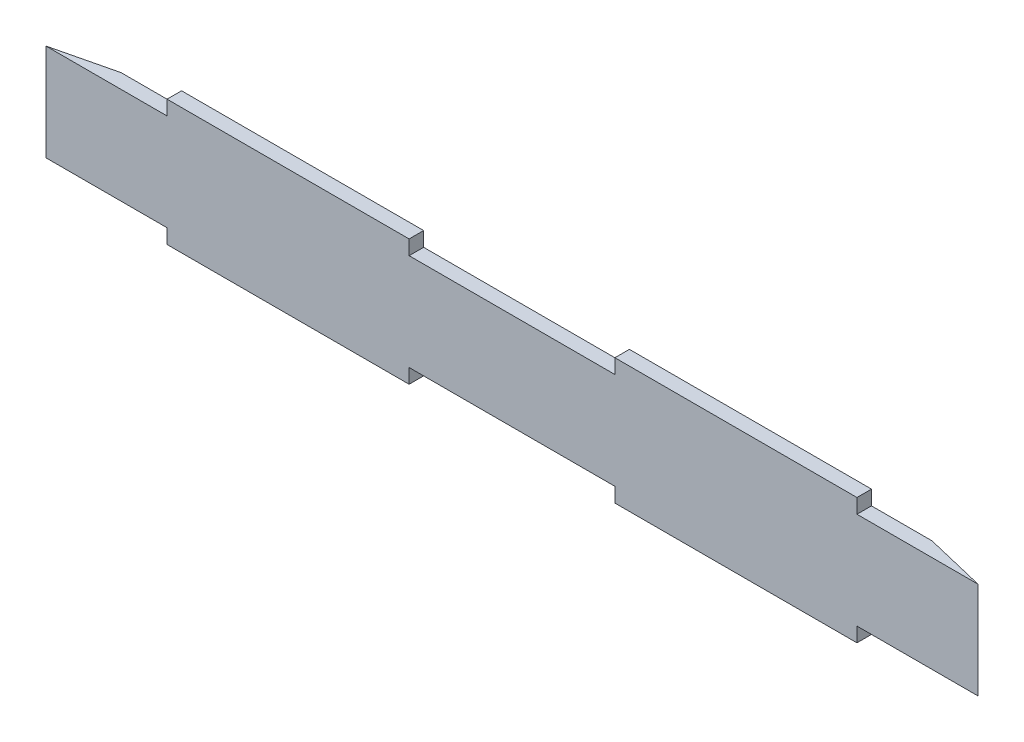
ISO-10303-21;
HEADER;
FILE_DESCRIPTION(('STEP AP214'),'2;1');
FILE_NAME('part.step','',(''),(''),'','','');
FILE_SCHEMA(('AUTOMOTIVE_DESIGN { 1 0 10303 214 1 1 1 1 }'));
ENDSEC;
DATA;
#1=APPLICATION_CONTEXT('core data for automotive mechanical design processes');
#2=APPLICATION_PROTOCOL_DEFINITION('international standard','automotive_design',2000,#1);
#3=PRODUCT_CONTEXT('',#1,'mechanical');
#4=PRODUCT('Part','Part','',(#3));
#5=PRODUCT_RELATED_PRODUCT_CATEGORY('part','',(#4));
#6=PRODUCT_DEFINITION_FORMATION('','',#4);
#7=PRODUCT_DEFINITION_CONTEXT('part definition',#1,'design');
#8=PRODUCT_DEFINITION('design','',#6,#7);
#9=PRODUCT_DEFINITION_SHAPE('','',#8);
#10=(LENGTH_UNIT() NAMED_UNIT(*) SI_UNIT(.MILLI.,.METRE.));
#11=(NAMED_UNIT(*) PLANE_ANGLE_UNIT() SI_UNIT($,.RADIAN.));
#12=(NAMED_UNIT(*) SI_UNIT($,.STERADIAN.) SOLID_ANGLE_UNIT());
#13=UNCERTAINTY_MEASURE_WITH_UNIT(LENGTH_MEASURE(1.E-05),#10,'distance_accuracy_value','');
#14=(GEOMETRIC_REPRESENTATION_CONTEXT(3) GLOBAL_UNCERTAINTY_ASSIGNED_CONTEXT((#13)) GLOBAL_UNIT_ASSIGNED_CONTEXT((#10,
#11,#12)) REPRESENTATION_CONTEXT('',''));
#15=CARTESIAN_POINT('',(0.,0.,0.));
#16=DIRECTION('',(0.,0.,1.));
#17=DIRECTION('',(1.,0.,0.));
#18=AXIS2_PLACEMENT_3D('',#15,#16,#17);
#19=CARTESIAN_POINT('',(192.5,-20.,6.));
#20=DIRECTION('',(0.,1.,0.));
#21=DIRECTION('',(-1.,0.,0.));
#22=AXIS2_PLACEMENT_3D('',#19,#20,#21);
#23=PLANE('',#22);
#24=DIRECTION('',(1.,0.,0.));
#25=VECTOR('',#24,1.);
#26=CARTESIAN_POINT('',(192.5,-20.,6.));
#27=LINE('',#26,#25);
#28=CARTESIAN_POINT('',(-192.5,-20.,6.));
#29=VERTEX_POINT('',#28);
#30=CARTESIAN_POINT('',(-142.5,-20.,6.));
#31=VERTEX_POINT('',#30);
#32=EDGE_CURVE('E199',#29,#31,#27,.T.);
#33=ORIENTED_EDGE('',*,*,#32,.F.);
#34=DIRECTION('',(0.972387301980517,0.,-0.233372952475325));
#35=VECTOR('',#34,1.);
#36=CARTESIAN_POINT('',(171.531770045386,-20.,-81.3676248108927));
#37=LINE('',#36,#35);
#38=CARTESIAN_POINT('',(-167.5,-20.,0.));
#39=VERTEX_POINT('',#38);
#40=EDGE_CURVE('E171',#29,#39,#37,.T.);
#41=ORIENTED_EDGE('',*,*,#40,.T.);
#42=DIRECTION('',(1.,0.,0.));
#43=VECTOR('',#42,1.);
#44=CARTESIAN_POINT('',(192.5,-20.,0.));
#45=LINE('',#44,#43);
#46=CARTESIAN_POINT('',(-142.5,-20.,0.));
#47=VERTEX_POINT('',#46);
#48=EDGE_CURVE('E209',#39,#47,#45,.T.);
#49=ORIENTED_EDGE('',*,*,#48,.T.);
#50=DIRECTION('',(0.,0.,1.));
#51=VECTOR('',#50,1.);
#52=CARTESIAN_POINT('',(-142.5,-20.,0.));
#53=LINE('',#52,#51);
#54=EDGE_CURVE('E269',#47,#31,#53,.T.);
#55=ORIENTED_EDGE('',*,*,#54,.T.);
#56=EDGE_LOOP('',(#33,#41,#49,#55));
#57=FACE_BOUND('',#56,.T.);
#58=ADVANCED_FACE('F34',(#57),#23,.F.);
#59=CARTESIAN_POINT('',(142.5,-20.,0.));
#60=VERTEX_POINT('',#59);
#61=CARTESIAN_POINT('',(167.5,-20.,0.));
#62=VERTEX_POINT('',#61);
#63=EDGE_CURVE('E211',#60,#62,#45,.T.);
#64=ORIENTED_EDGE('',*,*,#63,.T.);
#65=DIRECTION('',(0.972387301980518,0.,0.233372952475324));
#66=VECTOR('',#65,1.);
#67=CARTESIAN_POINT('',(192.5,-20.,6.));
#68=LINE('',#67,#66);
#69=CARTESIAN_POINT('',(192.5,-20.,6.));
#70=VERTEX_POINT('',#69);
#71=EDGE_CURVE('E49',#62,#70,#68,.T.);
#72=ORIENTED_EDGE('',*,*,#71,.T.);
#73=CARTESIAN_POINT('',(142.5,-20.,6.));
#74=VERTEX_POINT('',#73);
#75=EDGE_CURVE('E176',#74,#70,#27,.T.);
#76=ORIENTED_EDGE('',*,*,#75,.F.);
#77=DIRECTION('',(0.,0.,1.));
#78=VECTOR('',#77,1.);
#79=CARTESIAN_POINT('',(142.5,-20.,0.));
#80=LINE('',#79,#78);
#81=EDGE_CURVE('E246',#60,#74,#80,.T.);
#82=ORIENTED_EDGE('',*,*,#81,.F.);
#83=EDGE_LOOP('',(#64,#72,#76,#82));
#84=FACE_BOUND('',#83,.T.);
#85=ADVANCED_FACE('F245',(#84),#23,.F.);
#86=CARTESIAN_POINT('',(192.5,20.,6.));
#87=DIRECTION('',(0.,-1.,0.));
#88=DIRECTION('',(1.,0.,0.));
#89=AXIS2_PLACEMENT_3D('',#86,#87,#88);
#90=PLANE('',#89);
#91=DIRECTION('',(-1.,0.,0.));
#92=VECTOR('',#91,1.);
#93=CARTESIAN_POINT('',(192.5,20.,6.));
#94=LINE('',#93,#92);
#95=CARTESIAN_POINT('',(42.5,20.,6.));
#96=VERTEX_POINT('',#95);
#97=CARTESIAN_POINT('',(-42.5,20.,6.));
#98=VERTEX_POINT('',#97);
#99=EDGE_CURVE('E194',#96,#98,#94,.T.);
#100=ORIENTED_EDGE('',*,*,#99,.F.);
#101=DIRECTION('',(0.,0.,1.));
#102=VECTOR('',#101,1.);
#103=CARTESIAN_POINT('',(42.5,20.,0.));
#104=LINE('',#103,#102);
#105=CARTESIAN_POINT('',(42.5,20.,0.));
#106=VERTEX_POINT('',#105);
#107=EDGE_CURVE('E310',#106,#96,#104,.T.);
#108=ORIENTED_EDGE('',*,*,#107,.F.);
#109=DIRECTION('',(-1.,0.,0.));
#110=VECTOR('',#109,1.);
#111=CARTESIAN_POINT('',(192.5,20.,0.));
#112=LINE('',#111,#110);
#113=CARTESIAN_POINT('',(-42.5,20.,0.));
#114=VERTEX_POINT('',#113);
#115=EDGE_CURVE('E208',#106,#114,#112,.T.);
#116=ORIENTED_EDGE('',*,*,#115,.T.);
#117=DIRECTION('',(0.,0.,1.));
#118=VECTOR('',#117,1.);
#119=CARTESIAN_POINT('',(-42.5,20.,0.));
#120=LINE('',#119,#118);
#121=EDGE_CURVE('E225',#114,#98,#120,.T.);
#122=ORIENTED_EDGE('',*,*,#121,.T.);
#123=EDGE_LOOP('',(#100,#108,#116,#122));
#124=FACE_BOUND('',#123,.T.);
#125=ADVANCED_FACE('F359',(#124),#90,.F.);
#126=CARTESIAN_POINT('',(-142.5,20.,0.));
#127=VERTEX_POINT('',#126);
#128=CARTESIAN_POINT('',(-167.5,20.,0.));
#129=VERTEX_POINT('',#128);
#130=EDGE_CURVE('E186',#127,#129,#112,.T.);
#131=ORIENTED_EDGE('',*,*,#130,.T.);
#132=DIRECTION('',(0.972387301980517,0.,-0.233372952475324));
#133=VECTOR('',#132,1.);
#134=CARTESIAN_POINT('',(-192.5,20.,6.));
#135=LINE('',#134,#133);
#136=CARTESIAN_POINT('',(-192.5,20.,6.));
#137=VERTEX_POINT('',#136);
#138=EDGE_CURVE('E56',#137,#129,#135,.T.);
#139=ORIENTED_EDGE('',*,*,#138,.F.);
#140=CARTESIAN_POINT('',(-142.5,20.,6.));
#141=VERTEX_POINT('',#140);
#142=EDGE_CURVE('E184',#141,#137,#94,.T.);
#143=ORIENTED_EDGE('',*,*,#142,.F.);
#144=DIRECTION('',(0.,0.,1.));
#145=VECTOR('',#144,1.);
#146=CARTESIAN_POINT('',(-142.5,20.,0.));
#147=LINE('',#146,#145);
#148=EDGE_CURVE('E233',#127,#141,#147,.T.);
#149=ORIENTED_EDGE('',*,*,#148,.F.);
#150=EDGE_LOOP('',(#131,#139,#143,#149));
#151=FACE_BOUND('',#150,.T.);
#152=ADVANCED_FACE('F182',(#151),#90,.F.);
#153=CARTESIAN_POINT('',(-42.5,-20.,6.));
#154=VERTEX_POINT('',#153);
#155=CARTESIAN_POINT('',(42.5,-20.,6.));
#156=VERTEX_POINT('',#155);
#157=EDGE_CURVE('E236',#154,#156,#27,.T.);
#158=ORIENTED_EDGE('',*,*,#157,.F.);
#159=DIRECTION('',(0.,0.,1.));
#160=VECTOR('',#159,1.);
#161=CARTESIAN_POINT('',(-42.5,-20.,0.));
#162=LINE('',#161,#160);
#163=CARTESIAN_POINT('',(-42.5,-20.,0.));
#164=VERTEX_POINT('',#163);
#165=EDGE_CURVE('E272',#164,#154,#162,.T.);
#166=ORIENTED_EDGE('',*,*,#165,.F.);
#167=CARTESIAN_POINT('',(42.5,-20.,0.));
#168=VERTEX_POINT('',#167);
#169=EDGE_CURVE('E210',#164,#168,#45,.T.);
#170=ORIENTED_EDGE('',*,*,#169,.T.);
#171=DIRECTION('',(0.,0.,1.));
#172=VECTOR('',#171,1.);
#173=CARTESIAN_POINT('',(42.5,-20.,0.));
#174=LINE('',#173,#172);
#175=EDGE_CURVE('E292',#168,#156,#174,.T.);
#176=ORIENTED_EDGE('',*,*,#175,.T.);
#177=EDGE_LOOP('',(#158,#166,#170,#176));
#178=FACE_BOUND('',#177,.T.);
#179=ADVANCED_FACE('F36',(#178),#23,.F.);
#180=CARTESIAN_POINT('',(192.5,20.,6.));
#181=VERTEX_POINT('',#180);
#182=CARTESIAN_POINT('',(142.5,20.,6.));
#183=VERTEX_POINT('',#182);
#184=EDGE_CURVE('E197',#181,#183,#94,.T.);
#185=ORIENTED_EDGE('',*,*,#184,.F.);
#186=DIRECTION('',(0.972387301980517,0.,0.233372952475324));
#187=VECTOR('',#186,1.);
#188=CARTESIAN_POINT('',(192.5,20.,6.));
#189=LINE('',#188,#187);
#190=CARTESIAN_POINT('',(167.5,20.,0.));
#191=VERTEX_POINT('',#190);
#192=EDGE_CURVE('E187',#191,#181,#189,.T.);
#193=ORIENTED_EDGE('',*,*,#192,.F.);
#194=CARTESIAN_POINT('',(142.5,20.,0.));
#195=VERTEX_POINT('',#194);
#196=EDGE_CURVE('E177',#191,#195,#112,.T.);
#197=ORIENTED_EDGE('',*,*,#196,.T.);
#198=DIRECTION('',(0.,0.,1.));
#199=VECTOR('',#198,1.);
#200=CARTESIAN_POINT('',(142.5,20.,0.));
#201=LINE('',#200,#199);
#202=EDGE_CURVE('E321',#195,#183,#201,.T.);
#203=ORIENTED_EDGE('',*,*,#202,.T.);
#204=EDGE_LOOP('',(#185,#193,#197,#203));
#205=FACE_BOUND('',#204,.T.);
#206=ADVANCED_FACE('F361',(#205),#90,.F.);
#207=CARTESIAN_POINT('',(0.,0.,6.));
#208=DIRECTION('',(0.,0.,-1.));
#209=DIRECTION('',(-1.,0.,0.));
#210=AXIS2_PLACEMENT_3D('',#207,#208,#209);
#211=PLANE('',#210);
#212=DIRECTION('',(0.,-1.,0.));
#213=VECTOR('',#212,1.);
#214=CARTESIAN_POINT('',(-192.5,20.,6.));
#215=LINE('',#214,#213);
#216=EDGE_CURVE('E168',#137,#29,#215,.T.);
#217=ORIENTED_EDGE('',*,*,#216,.T.);
#218=ORIENTED_EDGE('',*,*,#32,.T.);
#219=DIRECTION('',(0.,-1.,0.));
#220=VECTOR('',#219,1.);
#221=CARTESIAN_POINT('',(-142.5,-20.,6.));
#222=LINE('',#221,#220);
#223=CARTESIAN_POINT('',(-142.5,-26.,6.));
#224=VERTEX_POINT('',#223);
#225=EDGE_CURVE('E248',#31,#224,#222,.T.);
#226=ORIENTED_EDGE('',*,*,#225,.T.);
#227=DIRECTION('',(1.,0.,0.));
#228=VECTOR('',#227,1.);
#229=CARTESIAN_POINT('',(-142.5,-26.,6.));
#230=LINE('',#229,#228);
#231=CARTESIAN_POINT('',(-42.5,-26.,6.));
#232=VERTEX_POINT('',#231);
#233=EDGE_CURVE('E264',#224,#232,#230,.T.);
#234=ORIENTED_EDGE('',*,*,#233,.T.);
#235=DIRECTION('',(0.,1.,0.));
#236=VECTOR('',#235,1.);
#237=CARTESIAN_POINT('',(-42.5,-20.,6.));
#238=LINE('',#237,#236);
#239=EDGE_CURVE('E256',#232,#154,#238,.T.);
#240=ORIENTED_EDGE('',*,*,#239,.T.);
#241=ORIENTED_EDGE('',*,*,#157,.T.);
#242=DIRECTION('',(0.,-1.,0.));
#243=VECTOR('',#242,1.);
#244=CARTESIAN_POINT('',(42.5,-20.,6.));
#245=LINE('',#244,#243);
#246=CARTESIAN_POINT('',(42.5,-26.,6.));
#247=VERTEX_POINT('',#246);
#248=EDGE_CURVE('E271',#156,#247,#245,.T.);
#249=ORIENTED_EDGE('',*,*,#248,.T.);
#250=DIRECTION('',(1.,0.,0.));
#251=VECTOR('',#250,1.);
#252=CARTESIAN_POINT('',(42.5,-26.,6.));
#253=LINE('',#252,#251);
#254=CARTESIAN_POINT('',(142.5,-26.,6.));
#255=VERTEX_POINT('',#254);
#256=EDGE_CURVE('E289',#247,#255,#253,.T.);
#257=ORIENTED_EDGE('',*,*,#256,.T.);
#258=DIRECTION('',(0.,1.,0.));
#259=VECTOR('',#258,1.);
#260=CARTESIAN_POINT('',(142.5,-20.,6.));
#261=LINE('',#260,#259);
#262=EDGE_CURVE('E244',#255,#74,#261,.T.);
#263=ORIENTED_EDGE('',*,*,#262,.T.);
#264=ORIENTED_EDGE('',*,*,#75,.T.);
#265=DIRECTION('',(0.,1.,0.));
#266=VECTOR('',#265,1.);
#267=CARTESIAN_POINT('',(192.5,20.,6.));
#268=LINE('',#267,#266);
#269=EDGE_CURVE('E195',#70,#181,#268,.T.);
#270=ORIENTED_EDGE('',*,*,#269,.T.);
#271=ORIENTED_EDGE('',*,*,#184,.T.);
#272=DIRECTION('',(0.,1.,0.));
#273=VECTOR('',#272,1.);
#274=CARTESIAN_POINT('',(142.5,20.,6.));
#275=LINE('',#274,#273);
#276=CARTESIAN_POINT('',(142.5,26.,6.));
#277=VERTEX_POINT('',#276);
#278=EDGE_CURVE('E313',#183,#277,#275,.T.);
#279=ORIENTED_EDGE('',*,*,#278,.T.);
#280=DIRECTION('',(-1.,0.,0.));
#281=VECTOR('',#280,1.);
#282=CARTESIAN_POINT('',(42.5,26.,6.));
#283=LINE('',#282,#281);
#284=CARTESIAN_POINT('',(42.5,26.,6.));
#285=VERTEX_POINT('',#284);
#286=EDGE_CURVE('E304',#277,#285,#283,.T.);
#287=ORIENTED_EDGE('',*,*,#286,.T.);
#288=DIRECTION('',(0.,-1.,0.));
#289=VECTOR('',#288,1.);
#290=CARTESIAN_POINT('',(42.5,20.,6.));
#291=LINE('',#290,#289);
#292=EDGE_CURVE('E295',#285,#96,#291,.T.);
#293=ORIENTED_EDGE('',*,*,#292,.T.);
#294=ORIENTED_EDGE('',*,*,#99,.T.);
#295=DIRECTION('',(0.,1.,0.));
#296=VECTOR('',#295,1.);
#297=CARTESIAN_POINT('',(-42.5,20.,6.));
#298=LINE('',#297,#296);
#299=CARTESIAN_POINT('',(-42.5,26.,6.));
#300=VERTEX_POINT('',#299);
#301=EDGE_CURVE('E331',#98,#300,#298,.T.);
#302=ORIENTED_EDGE('',*,*,#301,.T.);
#303=DIRECTION('',(-1.,0.,0.));
#304=VECTOR('',#303,1.);
#305=CARTESIAN_POINT('',(-142.5,26.,6.));
#306=LINE('',#305,#304);
#307=CARTESIAN_POINT('',(-142.5,26.,6.));
#308=VERTEX_POINT('',#307);
#309=EDGE_CURVE('E228',#300,#308,#306,.T.);
#310=ORIENTED_EDGE('',*,*,#309,.T.);
#311=DIRECTION('',(0.,-1.,0.));
#312=VECTOR('',#311,1.);
#313=CARTESIAN_POINT('',(-142.5,20.,6.));
#314=LINE('',#313,#312);
#315=EDGE_CURVE('E193',#308,#141,#314,.T.);
#316=ORIENTED_EDGE('',*,*,#315,.T.);
#317=ORIENTED_EDGE('',*,*,#142,.T.);
#318=EDGE_LOOP('',(#217,#218,#226,#234,#240,#241,#249,#257,#263,#264,#270,#271,#279,#287,#293,
#294,#302,#310,#316,#317));
#319=FACE_BOUND('',#318,.T.);
#320=ADVANCED_FACE('F190',(#319),#211,.F.);
#321=CARTESIAN_POINT('',(0.,0.,0.));
#322=DIRECTION('',(0.,0.,-1.));
#323=DIRECTION('',(-1.,0.,0.));
#324=AXIS2_PLACEMENT_3D('',#321,#322,#323);
#325=PLANE('',#324);
#326=DIRECTION('',(0.,-1.,0.));
#327=VECTOR('',#326,1.);
#328=CARTESIAN_POINT('',(-167.5,0.,0.));
#329=LINE('',#328,#327);
#330=EDGE_CURVE('E11',#129,#39,#329,.T.);
#331=ORIENTED_EDGE('',*,*,#330,.F.);
#332=ORIENTED_EDGE('',*,*,#130,.F.);
#333=DIRECTION('',(0.,-1.,0.));
#334=VECTOR('',#333,1.);
#335=CARTESIAN_POINT('',(-142.5,20.,0.));
#336=LINE('',#335,#334);
#337=CARTESIAN_POINT('',(-142.5,26.,0.));
#338=VERTEX_POINT('',#337);
#339=EDGE_CURVE('E325',#338,#127,#336,.T.);
#340=ORIENTED_EDGE('',*,*,#339,.F.);
#341=DIRECTION('',(-1.,0.,0.));
#342=VECTOR('',#341,1.);
#343=CARTESIAN_POINT('',(-142.5,26.,0.));
#344=LINE('',#343,#342);
#345=CARTESIAN_POINT('',(-42.5,26.,0.));
#346=VERTEX_POINT('',#345);
#347=EDGE_CURVE('E234',#346,#338,#344,.T.);
#348=ORIENTED_EDGE('',*,*,#347,.F.);
#349=DIRECTION('',(0.,1.,0.));
#350=VECTOR('',#349,1.);
#351=CARTESIAN_POINT('',(-42.5,20.,0.));
#352=LINE('',#351,#350);
#353=EDGE_CURVE('E327',#114,#346,#352,.T.);
#354=ORIENTED_EDGE('',*,*,#353,.F.);
#355=ORIENTED_EDGE('',*,*,#115,.F.);
#356=DIRECTION('',(0.,-1.,0.));
#357=VECTOR('',#356,1.);
#358=CARTESIAN_POINT('',(42.5,20.,0.));
#359=LINE('',#358,#357);
#360=CARTESIAN_POINT('',(42.5,26.,0.));
#361=VERTEX_POINT('',#360);
#362=EDGE_CURVE('E300',#361,#106,#359,.T.);
#363=ORIENTED_EDGE('',*,*,#362,.F.);
#364=DIRECTION('',(-1.,0.,0.));
#365=VECTOR('',#364,1.);
#366=CARTESIAN_POINT('',(42.5,26.,0.));
#367=LINE('',#366,#365);
#368=CARTESIAN_POINT('',(142.5,26.,0.));
#369=VERTEX_POINT('',#368);
#370=EDGE_CURVE('E307',#369,#361,#367,.T.);
#371=ORIENTED_EDGE('',*,*,#370,.F.);
#372=DIRECTION('',(0.,1.,0.));
#373=VECTOR('',#372,1.);
#374=CARTESIAN_POINT('',(142.5,20.,0.));
#375=LINE('',#374,#373);
#376=EDGE_CURVE('E303',#195,#369,#375,.T.);
#377=ORIENTED_EDGE('',*,*,#376,.F.);
#378=ORIENTED_EDGE('',*,*,#196,.F.);
#379=DIRECTION('',(0.,1.,0.));
#380=VECTOR('',#379,1.);
#381=CARTESIAN_POINT('',(167.5,0.,0.));
#382=LINE('',#381,#380);
#383=EDGE_CURVE('E42',#62,#191,#382,.T.);
#384=ORIENTED_EDGE('',*,*,#383,.F.);
#385=ORIENTED_EDGE('',*,*,#63,.F.);
#386=DIRECTION('',(0.,1.,0.));
#387=VECTOR('',#386,1.);
#388=CARTESIAN_POINT('',(142.5,-20.,0.));
#389=LINE('',#388,#387);
#390=CARTESIAN_POINT('',(142.5,-26.,0.));
#391=VERTEX_POINT('',#390);
#392=EDGE_CURVE('E284',#391,#60,#389,.T.);
#393=ORIENTED_EDGE('',*,*,#392,.F.);
#394=DIRECTION('',(1.,0.,0.));
#395=VECTOR('',#394,1.);
#396=CARTESIAN_POINT('',(42.5,-26.,0.));
#397=LINE('',#396,#395);
#398=CARTESIAN_POINT('',(42.5,-26.,0.));
#399=VERTEX_POINT('',#398);
#400=EDGE_CURVE('E281',#399,#391,#397,.T.);
#401=ORIENTED_EDGE('',*,*,#400,.F.);
#402=DIRECTION('',(0.,-1.,0.));
#403=VECTOR('',#402,1.);
#404=CARTESIAN_POINT('',(42.5,-20.,0.));
#405=LINE('',#404,#403);
#406=EDGE_CURVE('E278',#168,#399,#405,.T.);
#407=ORIENTED_EDGE('',*,*,#406,.F.);
#408=ORIENTED_EDGE('',*,*,#169,.F.);
#409=DIRECTION('',(0.,1.,0.));
#410=VECTOR('',#409,1.);
#411=CARTESIAN_POINT('',(-42.5,-20.,0.));
#412=LINE('',#411,#410);
#413=CARTESIAN_POINT('',(-42.5,-26.,0.));
#414=VERTEX_POINT('',#413);
#415=EDGE_CURVE('E259',#414,#164,#412,.T.);
#416=ORIENTED_EDGE('',*,*,#415,.F.);
#417=DIRECTION('',(1.,0.,0.));
#418=VECTOR('',#417,1.);
#419=CARTESIAN_POINT('',(-142.5,-26.,0.));
#420=LINE('',#419,#418);
#421=CARTESIAN_POINT('',(-142.5,-26.,0.));
#422=VERTEX_POINT('',#421);
#423=EDGE_CURVE('E255',#422,#414,#420,.T.);
#424=ORIENTED_EDGE('',*,*,#423,.F.);
#425=DIRECTION('',(0.,-1.,0.));
#426=VECTOR('',#425,1.);
#427=CARTESIAN_POINT('',(-142.5,-20.,0.));
#428=LINE('',#427,#426);
#429=EDGE_CURVE('E252',#47,#422,#428,.T.);
#430=ORIENTED_EDGE('',*,*,#429,.F.);
#431=ORIENTED_EDGE('',*,*,#48,.F.);
#432=EDGE_LOOP('',(#331,#332,#340,#348,#354,#355,#363,#371,#377,#378,#384,#385,#393,#401,#407,
#408,#416,#424,#430,#431));
#433=FACE_BOUND('',#432,.T.);
#434=ADVANCED_FACE('F342',(#433),#325,.T.);
#435=CARTESIAN_POINT('',(-142.5,20.,0.));
#436=DIRECTION('',(-1.,0.,0.));
#437=DIRECTION('',(0.,-1.,0.));
#438=AXIS2_PLACEMENT_3D('',#435,#436,#437);
#439=PLANE('',#438);
#440=ORIENTED_EDGE('',*,*,#315,.F.);
#441=DIRECTION('',(0.,0.,1.));
#442=VECTOR('',#441,1.);
#443=CARTESIAN_POINT('',(-142.5,26.,0.));
#444=LINE('',#443,#442);
#445=EDGE_CURVE('E216',#338,#308,#444,.T.);
#446=ORIENTED_EDGE('',*,*,#445,.F.);
#447=ORIENTED_EDGE('',*,*,#339,.T.);
#448=ORIENTED_EDGE('',*,*,#148,.T.);
#449=EDGE_LOOP('',(#440,#446,#447,#448));
#450=FACE_BOUND('',#449,.T.);
#451=ADVANCED_FACE('F344',(#450),#439,.T.);
#452=CARTESIAN_POINT('',(-142.5,26.,0.));
#453=DIRECTION('',(0.,1.,0.));
#454=DIRECTION('',(0.,0.,1.));
#455=AXIS2_PLACEMENT_3D('',#452,#453,#454);
#456=PLANE('',#455);
#457=ORIENTED_EDGE('',*,*,#309,.F.);
#458=DIRECTION('',(0.,0.,1.));
#459=VECTOR('',#458,1.);
#460=CARTESIAN_POINT('',(-42.5,26.,0.));
#461=LINE('',#460,#459);
#462=EDGE_CURVE('E220',#346,#300,#461,.T.);
#463=ORIENTED_EDGE('',*,*,#462,.F.);
#464=ORIENTED_EDGE('',*,*,#347,.T.);
#465=ORIENTED_EDGE('',*,*,#445,.T.);
#466=EDGE_LOOP('',(#457,#463,#464,#465));
#467=FACE_BOUND('',#466,.T.);
#468=ADVANCED_FACE('F334',(#467),#456,.T.);
#469=CARTESIAN_POINT('',(-42.5,20.,0.));
#470=DIRECTION('',(1.,0.,0.));
#471=DIRECTION('',(0.,0.,-1.));
#472=AXIS2_PLACEMENT_3D('',#469,#470,#471);
#473=PLANE('',#472);
#474=ORIENTED_EDGE('',*,*,#301,.F.);
#475=ORIENTED_EDGE('',*,*,#121,.F.);
#476=ORIENTED_EDGE('',*,*,#353,.T.);
#477=ORIENTED_EDGE('',*,*,#462,.T.);
#478=EDGE_LOOP('',(#474,#475,#476,#477));
#479=FACE_BOUND('',#478,.T.);
#480=ADVANCED_FACE('F339',(#479),#473,.T.);
#481=CARTESIAN_POINT('',(42.5,20.,0.));
#482=DIRECTION('',(-1.,0.,0.));
#483=DIRECTION('',(0.,0.,1.));
#484=AXIS2_PLACEMENT_3D('',#481,#482,#483);
#485=PLANE('',#484);
#486=ORIENTED_EDGE('',*,*,#292,.F.);
#487=DIRECTION('',(0.,0.,1.));
#488=VECTOR('',#487,1.);
#489=CARTESIAN_POINT('',(42.5,26.,0.));
#490=LINE('',#489,#488);
#491=EDGE_CURVE('E317',#361,#285,#490,.T.);
#492=ORIENTED_EDGE('',*,*,#491,.F.);
#493=ORIENTED_EDGE('',*,*,#362,.T.);
#494=ORIENTED_EDGE('',*,*,#107,.T.);
#495=EDGE_LOOP('',(#486,#492,#493,#494));
#496=FACE_BOUND('',#495,.T.);
#497=ADVANCED_FACE('F402',(#496),#485,.T.);
#498=CARTESIAN_POINT('',(42.5,26.,0.));
#499=DIRECTION('',(0.,1.,0.));
#500=DIRECTION('',(0.,0.,1.));
#501=AXIS2_PLACEMENT_3D('',#498,#499,#500);
#502=PLANE('',#501);
#503=ORIENTED_EDGE('',*,*,#286,.F.);
#504=DIRECTION('',(0.,0.,1.));
#505=VECTOR('',#504,1.);
#506=CARTESIAN_POINT('',(142.5,26.,0.));
#507=LINE('',#506,#505);
#508=EDGE_CURVE('E319',#369,#277,#507,.T.);
#509=ORIENTED_EDGE('',*,*,#508,.F.);
#510=ORIENTED_EDGE('',*,*,#370,.T.);
#511=ORIENTED_EDGE('',*,*,#491,.T.);
#512=EDGE_LOOP('',(#503,#509,#510,#511));
#513=FACE_BOUND('',#512,.T.);
#514=ADVANCED_FACE('F398',(#513),#502,.T.);
#515=CARTESIAN_POINT('',(142.5,20.,0.));
#516=DIRECTION('',(1.,0.,0.));
#517=DIRECTION('',(0.,0.,-1.));
#518=AXIS2_PLACEMENT_3D('',#515,#516,#517);
#519=PLANE('',#518);
#520=ORIENTED_EDGE('',*,*,#278,.F.);
#521=ORIENTED_EDGE('',*,*,#202,.F.);
#522=ORIENTED_EDGE('',*,*,#376,.T.);
#523=ORIENTED_EDGE('',*,*,#508,.T.);
#524=EDGE_LOOP('',(#520,#521,#522,#523));
#525=FACE_BOUND('',#524,.T.);
#526=ADVANCED_FACE('F395',(#525),#519,.T.);
#527=CARTESIAN_POINT('',(42.5,-20.,0.));
#528=DIRECTION('',(-1.,0.,0.));
#529=DIRECTION('',(0.,0.,1.));
#530=AXIS2_PLACEMENT_3D('',#527,#528,#529);
#531=PLANE('',#530);
#532=ORIENTED_EDGE('',*,*,#248,.F.);
#533=ORIENTED_EDGE('',*,*,#175,.F.);
#534=ORIENTED_EDGE('',*,*,#406,.T.);
#535=DIRECTION('',(0.,0.,1.));
#536=VECTOR('',#535,1.);
#537=CARTESIAN_POINT('',(42.5,-26.,0.));
#538=LINE('',#537,#536);
#539=EDGE_CURVE('E286',#399,#247,#538,.T.);
#540=ORIENTED_EDGE('',*,*,#539,.T.);
#541=EDGE_LOOP('',(#532,#533,#534,#540));
#542=FACE_BOUND('',#541,.T.);
#543=ADVANCED_FACE('F383',(#542),#531,.T.);
#544=CARTESIAN_POINT('',(142.5,-20.,0.));
#545=DIRECTION('',(1.,0.,0.));
#546=DIRECTION('',(0.,0.,-1.));
#547=AXIS2_PLACEMENT_3D('',#544,#545,#546);
#548=PLANE('',#547);
#549=ORIENTED_EDGE('',*,*,#262,.F.);
#550=DIRECTION('',(0.,0.,1.));
#551=VECTOR('',#550,1.);
#552=CARTESIAN_POINT('',(142.5,-26.,0.));
#553=LINE('',#552,#551);
#554=EDGE_CURVE('E297',#391,#255,#553,.T.);
#555=ORIENTED_EDGE('',*,*,#554,.F.);
#556=ORIENTED_EDGE('',*,*,#392,.T.);
#557=ORIENTED_EDGE('',*,*,#81,.T.);
#558=EDGE_LOOP('',(#549,#555,#556,#557));
#559=FACE_BOUND('',#558,.T.);
#560=ADVANCED_FACE('F389',(#559),#548,.T.);
#561=CARTESIAN_POINT('',(42.5,-26.,0.));
#562=DIRECTION('',(0.,-1.,0.));
#563=DIRECTION('',(0.,0.,-1.));
#564=AXIS2_PLACEMENT_3D('',#561,#562,#563);
#565=PLANE('',#564);
#566=ORIENTED_EDGE('',*,*,#256,.F.);
#567=ORIENTED_EDGE('',*,*,#539,.F.);
#568=ORIENTED_EDGE('',*,*,#400,.T.);
#569=ORIENTED_EDGE('',*,*,#554,.T.);
#570=EDGE_LOOP('',(#566,#567,#568,#569));
#571=FACE_BOUND('',#570,.T.);
#572=ADVANCED_FACE('F386',(#571),#565,.T.);
#573=CARTESIAN_POINT('',(-142.5,-20.,0.));
#574=DIRECTION('',(-1.,0.,0.));
#575=DIRECTION('',(0.,-1.,0.));
#576=AXIS2_PLACEMENT_3D('',#573,#574,#575);
#577=PLANE('',#576);
#578=ORIENTED_EDGE('',*,*,#225,.F.);
#579=ORIENTED_EDGE('',*,*,#54,.F.);
#580=ORIENTED_EDGE('',*,*,#429,.T.);
#581=DIRECTION('',(0.,0.,1.));
#582=VECTOR('',#581,1.);
#583=CARTESIAN_POINT('',(-142.5,-26.,0.));
#584=LINE('',#583,#582);
#585=EDGE_CURVE('E262',#422,#224,#584,.T.);
#586=ORIENTED_EDGE('',*,*,#585,.T.);
#587=EDGE_LOOP('',(#578,#579,#580,#586));
#588=FACE_BOUND('',#587,.T.);
#589=ADVANCED_FACE('F509',(#588),#577,.T.);
#590=CARTESIAN_POINT('',(-42.5,-20.,0.));
#591=DIRECTION('',(1.,0.,0.));
#592=DIRECTION('',(0.,0.,-1.));
#593=AXIS2_PLACEMENT_3D('',#590,#591,#592);
#594=PLANE('',#593);
#595=ORIENTED_EDGE('',*,*,#239,.F.);
#596=DIRECTION('',(0.,0.,1.));
#597=VECTOR('',#596,1.);
#598=CARTESIAN_POINT('',(-42.5,-26.,0.));
#599=LINE('',#598,#597);
#600=EDGE_CURVE('E275',#414,#232,#599,.T.);
#601=ORIENTED_EDGE('',*,*,#600,.F.);
#602=ORIENTED_EDGE('',*,*,#415,.T.);
#603=ORIENTED_EDGE('',*,*,#165,.T.);
#604=EDGE_LOOP('',(#595,#601,#602,#603));
#605=FACE_BOUND('',#604,.T.);
#606=ADVANCED_FACE('F373',(#605),#594,.T.);
#607=CARTESIAN_POINT('',(-142.5,-26.,0.));
#608=DIRECTION('',(0.,-1.,0.));
#609=DIRECTION('',(0.,0.,-1.));
#610=AXIS2_PLACEMENT_3D('',#607,#608,#609);
#611=PLANE('',#610);
#612=ORIENTED_EDGE('',*,*,#233,.F.);
#613=ORIENTED_EDGE('',*,*,#585,.F.);
#614=ORIENTED_EDGE('',*,*,#423,.T.);
#615=ORIENTED_EDGE('',*,*,#600,.T.);
#616=EDGE_LOOP('',(#612,#613,#614,#615));
#617=FACE_BOUND('',#616,.T.);
#618=ADVANCED_FACE('F377',(#617),#611,.T.);
#619=CARTESIAN_POINT('',(192.5,-26.,6.));
#620=DIRECTION('',(-0.233372952475324,0.,0.972387301980517));
#621=DIRECTION('',(0.972387301980518,0.,0.233372952475324));
#622=AXIS2_PLACEMENT_3D('',#619,#620,#621);
#623=PLANE('',#622);
#624=ORIENTED_EDGE('',*,*,#383,.T.);
#625=ORIENTED_EDGE('',*,*,#192,.T.);
#626=ORIENTED_EDGE('',*,*,#269,.F.);
#627=ORIENTED_EDGE('',*,*,#71,.F.);
#628=EDGE_LOOP('',(#624,#625,#626,#627));
#629=FACE_BOUND('',#628,.T.);
#630=ADVANCED_FACE('F532',(#629),#623,.F.);
#631=CARTESIAN_POINT('',(-192.5,-26.0000000000001,6.));
#632=DIRECTION('',(0.233372952475324,0.,0.972387301980517));
#633=DIRECTION('',(0.972387301980517,0.,-0.233372952475325));
#634=AXIS2_PLACEMENT_3D('',#631,#632,#633);
#635=PLANE('',#634);
#636=ORIENTED_EDGE('',*,*,#216,.F.);
#637=ORIENTED_EDGE('',*,*,#138,.T.);
#638=ORIENTED_EDGE('',*,*,#330,.T.);
#639=ORIENTED_EDGE('',*,*,#40,.F.);
#640=EDGE_LOOP('',(#636,#637,#638,#639));
#641=FACE_BOUND('',#640,.T.);
#642=ADVANCED_FACE('F169',(#641),#635,.F.);
#643=CLOSED_SHELL('',(#58,#85,#125,#152,#179,#206,#320,#434,#451,#468,#480,#497,#514,#526,#543,
#560,#572,#589,#606,#618,#630,#642));
#644=MANIFOLD_SOLID_BREP('B2',#643);
#645=ADVANCED_BREP_SHAPE_REPRESENTATION('',(#18,#644),#14);
#646=SHAPE_DEFINITION_REPRESENTATION(#9,#645);
ENDSEC;
END-ISO-10303-21;
